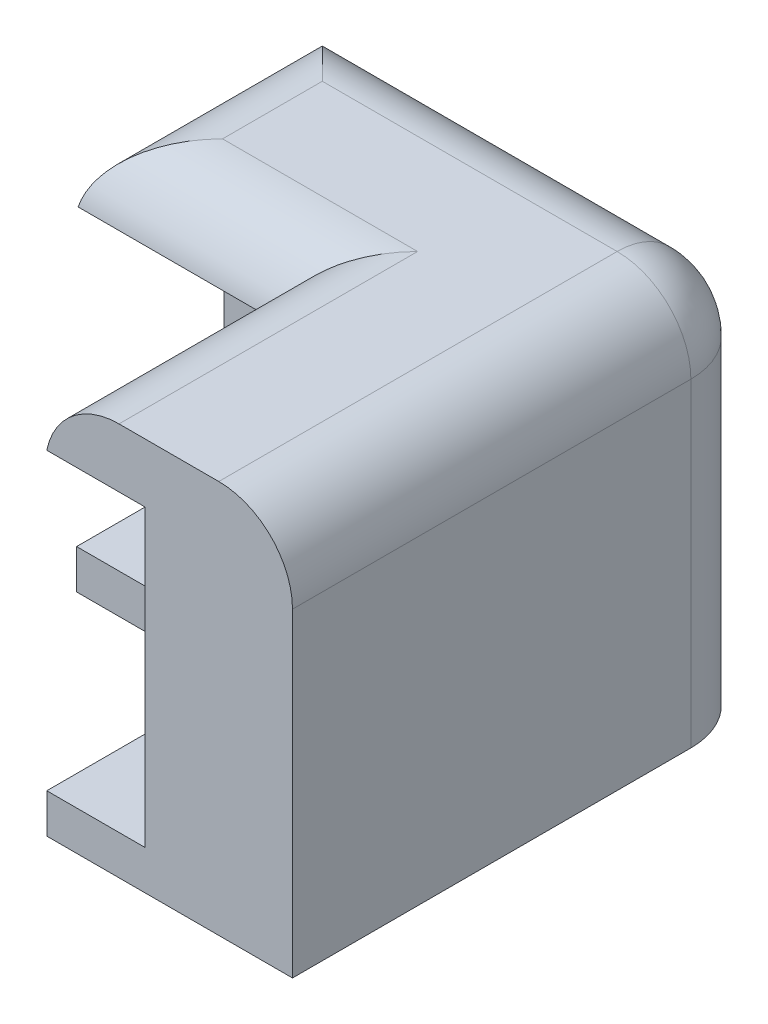
ISO-10303-21;
HEADER;
FILE_DESCRIPTION(('STEP AP214'),'2;1');
FILE_NAME('part.step','',(''),(''),'','','');
FILE_SCHEMA(('AUTOMOTIVE_DESIGN { 1 0 10303 214 1 1 1 1 }'));
ENDSEC;
DATA;
#1=APPLICATION_CONTEXT('core data for automotive mechanical design processes');
#2=APPLICATION_PROTOCOL_DEFINITION('international standard','automotive_design',2000,#1);
#3=PRODUCT_CONTEXT('',#1,'mechanical');
#4=PRODUCT('Part','Part','',(#3));
#5=PRODUCT_RELATED_PRODUCT_CATEGORY('part','',(#4));
#6=PRODUCT_DEFINITION_FORMATION('','',#4);
#7=PRODUCT_DEFINITION_CONTEXT('part definition',#1,'design');
#8=PRODUCT_DEFINITION('design','',#6,#7);
#9=PRODUCT_DEFINITION_SHAPE('','',#8);
#10=(LENGTH_UNIT() NAMED_UNIT(*) SI_UNIT(.MILLI.,.METRE.));
#11=(NAMED_UNIT(*) PLANE_ANGLE_UNIT() SI_UNIT($,.RADIAN.));
#12=(NAMED_UNIT(*) SI_UNIT($,.STERADIAN.) SOLID_ANGLE_UNIT());
#13=UNCERTAINTY_MEASURE_WITH_UNIT(LENGTH_MEASURE(1.E-05),#10,'distance_accuracy_value','');
#14=(GEOMETRIC_REPRESENTATION_CONTEXT(3) GLOBAL_UNCERTAINTY_ASSIGNED_CONTEXT((#13)) GLOBAL_UNIT_ASSIGNED_CONTEXT((#10,
#11,#12)) REPRESENTATION_CONTEXT('',''));
#15=CARTESIAN_POINT('',(0.,0.,0.));
#16=DIRECTION('',(0.,0.,1.));
#17=DIRECTION('',(1.,0.,0.));
#18=AXIS2_PLACEMENT_3D('',#15,#16,#17);
#19=CARTESIAN_POINT('',(0.,16.,0.));
#20=DIRECTION('',(0.,-1.,0.));
#21=DIRECTION('',(0.,0.,-1.));
#22=AXIS2_PLACEMENT_3D('',#19,#20,#21);
#23=PLANE('',#22);
#24=DIRECTION('',(0.,0.,-1.));
#25=VECTOR('',#24,1.);
#26=CARTESIAN_POINT('',(101.93938769134,16.,0.));
#27=LINE('',#26,#25);
#28=CARTESIAN_POINT('',(101.93938769134,16.,-59.9393876913398));
#29=VERTEX_POINT('',#28);
#30=CARTESIAN_POINT('',(101.93938769134,16.,-47.7864217896502));
#31=VERTEX_POINT('',#30);
#32=EDGE_CURVE('E189',#29,#31,#27,.F.);
#33=ORIENTED_EDGE('',*,*,#32,.T.);
#34=DIRECTION('',(1.,0.,0.));
#35=VECTOR('',#34,1.);
#36=CARTESIAN_POINT('',(0.,16.,-47.7864217896502));
#37=LINE('',#36,#35);
#38=CARTESIAN_POINT('',(106.,16.,-47.7864217896502));
#39=VERTEX_POINT('',#38);
#40=EDGE_CURVE('E151',#31,#39,#37,.T.);
#41=ORIENTED_EDGE('',*,*,#40,.T.);
#42=DIRECTION('',(0.,0.,-1.));
#43=VECTOR('',#42,1.);
#44=CARTESIAN_POINT('',(106.,16.,0.));
#45=LINE('',#44,#43);
#46=CARTESIAN_POINT('',(106.,16.,-64.));
#47=VERTEX_POINT('',#46);
#48=EDGE_CURVE('E181',#39,#47,#45,.T.);
#49=ORIENTED_EDGE('',*,*,#48,.T.);
#50=DIRECTION('',(-1.,0.,0.));
#51=VECTOR('',#50,1.);
#52=CARTESIAN_POINT('',(0.,16.,-64.));
#53=LINE('',#52,#51);
#54=CARTESIAN_POINT('',(94.,16.,-64.));
#55=VERTEX_POINT('',#54);
#56=EDGE_CURVE('E183',#47,#55,#53,.T.);
#57=ORIENTED_EDGE('',*,*,#56,.T.);
#58=DIRECTION('',(0.,0.,1.));
#59=VECTOR('',#58,1.);
#60=CARTESIAN_POINT('',(94.,16.,0.));
#61=LINE('',#60,#59);
#62=CARTESIAN_POINT('',(94.,16.,-59.9393876913398));
#63=VERTEX_POINT('',#62);
#64=EDGE_CURVE('E185',#55,#63,#61,.T.);
#65=ORIENTED_EDGE('',*,*,#64,.T.);
#66=DIRECTION('',(-1.,0.,0.));
#67=VECTOR('',#66,1.);
#68=CARTESIAN_POINT('',(0.,16.,-59.9393876913398));
#69=LINE('',#68,#67);
#70=EDGE_CURVE('E187',#63,#29,#69,.F.);
#71=ORIENTED_EDGE('',*,*,#70,.T.);
#72=EDGE_LOOP('',(#33,#41,#49,#57,#65,#71));
#73=FACE_BOUND('',#72,.T.);
#74=ADVANCED_FACE('F40',(#73),#23,.F.);
#75=CARTESIAN_POINT('',(0.,0.,0.));
#76=DIRECTION('',(0.,-1.,0.));
#77=DIRECTION('',(0.,0.,-1.));
#78=AXIS2_PLACEMENT_3D('',#75,#76,#77);
#79=PLANE('',#78);
#80=DIRECTION('',(1.,0.,0.));
#81=VECTOR('',#80,1.);
#82=CARTESIAN_POINT('',(-191.,0.,-47.7864217896502));
#83=LINE('',#82,#81);
#84=CARTESIAN_POINT('',(99.0000000000001,0.,-47.7864217896502));
#85=VERTEX_POINT('',#84);
#86=CARTESIAN_POINT('',(109.,0.,-47.7864217896502));
#87=VERTEX_POINT('',#86);
#88=EDGE_CURVE('E144',#85,#87,#83,.T.);
#89=ORIENTED_EDGE('',*,*,#88,.F.);
#90=DIRECTION('',(0.,0.,-1.));
#91=VECTOR('',#90,1.);
#92=CARTESIAN_POINT('',(99.0000000000001,0.,57.));
#93=LINE('',#92,#91);
#94=CARTESIAN_POINT('',(99.0000000000001,0.,-57.));
#95=VERTEX_POINT('',#94);
#96=EDGE_CURVE('E254',#85,#95,#93,.T.);
#97=ORIENTED_EDGE('',*,*,#96,.T.);
#98=DIRECTION('',(-1.,0.,0.));
#99=VECTOR('',#98,1.);
#100=CARTESIAN_POINT('',(-98.9999999999999,0.,-57.));
#101=LINE('',#100,#99);
#102=CARTESIAN_POINT('',(91.,0.,-57.));
#103=VERTEX_POINT('',#102);
#104=EDGE_CURVE('E172',#95,#103,#101,.T.);
#105=ORIENTED_EDGE('',*,*,#104,.T.);
#106=DIRECTION('',(0.,0.,-1.));
#107=VECTOR('',#106,1.);
#108=CARTESIAN_POINT('',(91.,0.,133.));
#109=LINE('',#108,#107);
#110=CARTESIAN_POINT('',(91.,0.,-67.));
#111=VERTEX_POINT('',#110);
#112=EDGE_CURVE('E258',#103,#111,#109,.T.);
#113=ORIENTED_EDGE('',*,*,#112,.T.);
#114=DIRECTION('',(-1.,0.,0.));
#115=VECTOR('',#114,1.);
#116=CARTESIAN_POINT('',(-109.,0.,-67.));
#117=LINE('',#116,#115);
#118=CARTESIAN_POINT('',(106.,0.,-67.));
#119=VERTEX_POINT('',#118);
#120=EDGE_CURVE('E166',#119,#111,#117,.T.);
#121=ORIENTED_EDGE('',*,*,#120,.F.);
#122=CARTESIAN_POINT('',(106.,0.,-64.));
#123=DIRECTION('',(0.,-1.,0.));
#124=DIRECTION('',(0.,0.,-1.));
#125=AXIS2_PLACEMENT_3D('',#122,#123,#124);
#126=CIRCLE('',#125,3.);
#127=CARTESIAN_POINT('',(109.,0.,-64.));
#128=VERTEX_POINT('',#127);
#129=EDGE_CURVE('E164',#119,#128,#126,.T.);
#130=ORIENTED_EDGE('',*,*,#129,.T.);
#131=DIRECTION('',(0.,0.,-1.));
#132=VECTOR('',#131,1.);
#133=CARTESIAN_POINT('',(109.,0.,67.));
#134=LINE('',#133,#132);
#135=EDGE_CURVE('E157',#87,#128,#134,.T.);
#136=ORIENTED_EDGE('',*,*,#135,.F.);
#137=EDGE_LOOP('',(#89,#97,#105,#113,#121,#130,#136));
#138=FACE_BOUND('',#137,.T.);
#139=ADVANCED_FACE('F161',(#138),#79,.T.);
#140=CARTESIAN_POINT('',(109.,16.,67.));
#141=DIRECTION('',(-1.,0.,0.));
#142=DIRECTION('',(0.,0.,1.));
#143=AXIS2_PLACEMENT_3D('',#140,#141,#142);
#144=PLANE('',#143);
#145=DIRECTION('',(0.,0.,-1.));
#146=VECTOR('',#145,1.);
#147=CARTESIAN_POINT('',(109.,13.,67.));
#148=LINE('',#147,#146);
#149=CARTESIAN_POINT('',(109.,13.,-64.));
#150=VERTEX_POINT('',#149);
#151=CARTESIAN_POINT('',(109.,13.,-47.7864217896502));
#152=VERTEX_POINT('',#151);
#153=EDGE_CURVE('E48',#150,#152,#148,.F.);
#154=ORIENTED_EDGE('',*,*,#153,.T.);
#155=DIRECTION('',(0.,1.,0.));
#156=VECTOR('',#155,1.);
#157=CARTESIAN_POINT('',(109.,0.,-47.7864217896502));
#158=LINE('',#157,#156);
#159=EDGE_CURVE('E54',#87,#152,#158,.T.);
#160=ORIENTED_EDGE('',*,*,#159,.F.);
#161=ORIENTED_EDGE('',*,*,#135,.T.);
#162=DIRECTION('',(0.,-1.,0.));
#163=VECTOR('',#162,1.);
#164=CARTESIAN_POINT('',(109.,16.,-64.));
#165=LINE('',#164,#163);
#166=EDGE_CURVE('E179',#128,#150,#165,.F.);
#167=ORIENTED_EDGE('',*,*,#166,.T.);
#168=EDGE_LOOP('',(#154,#160,#161,#167));
#169=FACE_BOUND('',#168,.T.);
#170=ADVANCED_FACE('F155',(#169),#144,.F.);
#171=CARTESIAN_POINT('',(-109.,16.,-67.));
#172=DIRECTION('',(0.,0.,1.));
#173=DIRECTION('',(1.,0.,0.));
#174=AXIS2_PLACEMENT_3D('',#171,#172,#173);
#175=PLANE('',#174);
#176=ORIENTED_EDGE('',*,*,#120,.T.);
#177=DIRECTION('',(0.,1.,0.));
#178=VECTOR('',#177,1.);
#179=CARTESIAN_POINT('',(91.,16.,-67.));
#180=LINE('',#179,#178);
#181=CARTESIAN_POINT('',(91.,13.,-67.));
#182=VERTEX_POINT('',#181);
#183=EDGE_CURVE('E216',#111,#182,#180,.T.);
#184=ORIENTED_EDGE('',*,*,#183,.T.);
#185=DIRECTION('',(-1.,0.,0.));
#186=VECTOR('',#185,1.);
#187=CARTESIAN_POINT('',(-109.,13.,-67.));
#188=LINE('',#187,#186);
#189=CARTESIAN_POINT('',(106.,13.,-67.));
#190=VERTEX_POINT('',#189);
#191=EDGE_CURVE('E198',#182,#190,#188,.F.);
#192=ORIENTED_EDGE('',*,*,#191,.T.);
#193=DIRECTION('',(0.,-1.,0.));
#194=VECTOR('',#193,1.);
#195=CARTESIAN_POINT('',(106.,16.,-67.));
#196=LINE('',#195,#194);
#197=EDGE_CURVE('E177',#190,#119,#196,.T.);
#198=ORIENTED_EDGE('',*,*,#197,.T.);
#199=EDGE_LOOP('',(#176,#184,#192,#198));
#200=FACE_BOUND('',#199,.T.);
#201=ADVANCED_FACE('F318',(#200),#175,.F.);
#202=CARTESIAN_POINT('',(99.0000000000001,16.,57.));
#203=DIRECTION('',(-1.,0.,0.));
#204=DIRECTION('',(0.,0.,1.));
#205=AXIS2_PLACEMENT_3D('',#202,#203,#204);
#206=PLANE('',#205);
#207=DIRECTION('',(0.,-1.,0.));
#208=VECTOR('',#207,1.);
#209=CARTESIAN_POINT('',(99.0000000000001,16.,-47.7864217896502));
#210=LINE('',#209,#208);
#211=CARTESIAN_POINT('',(99.0000000000001,1.59999999999999,-47.7864217896502));
#212=VERTEX_POINT('',#211);
#213=EDGE_CURVE('E147',#212,#85,#210,.T.);
#214=ORIENTED_EDGE('',*,*,#213,.F.);
#215=DIRECTION('',(0.,0.,1.));
#216=VECTOR('',#215,1.);
#217=CARTESIAN_POINT('',(99.0000000000001,1.59999999999999,57.));
#218=LINE('',#217,#216);
#219=CARTESIAN_POINT('',(99.0000000000001,1.59999999999999,-57.));
#220=VERTEX_POINT('',#219);
#221=EDGE_CURVE('E247',#220,#212,#218,.T.);
#222=ORIENTED_EDGE('',*,*,#221,.F.);
#223=DIRECTION('',(0.,-1.,0.));
#224=VECTOR('',#223,1.);
#225=CARTESIAN_POINT('',(99.0000000000001,16.,-57.));
#226=LINE('',#225,#224);
#227=EDGE_CURVE('E167',#220,#95,#226,.T.);
#228=ORIENTED_EDGE('',*,*,#227,.T.);
#229=ORIENTED_EDGE('',*,*,#96,.F.);
#230=EDGE_LOOP('',(#214,#222,#228,#229));
#231=FACE_BOUND('',#230,.T.);
#232=ADVANCED_FACE('F316',(#231),#206,.T.);
#233=CARTESIAN_POINT('',(-98.9999999999999,16.,-57.));
#234=DIRECTION('',(0.,0.,1.));
#235=DIRECTION('',(1.,0.,0.));
#236=AXIS2_PLACEMENT_3D('',#233,#234,#235);
#237=PLANE('',#236);
#238=DIRECTION('',(0.,1.,0.));
#239=VECTOR('',#238,1.);
#240=CARTESIAN_POINT('',(91.,16.,-57.));
#241=LINE('',#240,#239);
#242=CARTESIAN_POINT('',(91.,1.59999999999999,-57.));
#243=VERTEX_POINT('',#242);
#244=EDGE_CURVE('E62',#103,#243,#241,.T.);
#245=ORIENTED_EDGE('',*,*,#244,.F.);
#246=ORIENTED_EDGE('',*,*,#104,.F.);
#247=ORIENTED_EDGE('',*,*,#227,.F.);
#248=DIRECTION('',(1.,0.,0.));
#249=VECTOR('',#248,1.);
#250=CARTESIAN_POINT('',(-98.9999999999999,1.59999999999999,-57.));
#251=LINE('',#250,#249);
#252=EDGE_CURVE('E243',#243,#220,#251,.T.);
#253=ORIENTED_EDGE('',*,*,#252,.F.);
#254=EDGE_LOOP('',(#245,#246,#247,#253));
#255=FACE_BOUND('',#254,.T.);
#256=ADVANCED_FACE('F261',(#255),#237,.T.);
#257=CARTESIAN_POINT('',(103.,1.59999999999999,-63.));
#258=DIRECTION('',(0.,0.,-1.));
#259=DIRECTION('',(-1.,0.,0.));
#260=AXIS2_PLACEMENT_3D('',#257,#258,#259);
#261=PLANE('',#260);
#262=DIRECTION('',(-1.,0.,0.));
#263=VECTOR('',#262,1.);
#264=CARTESIAN_POINT('',(103.,13.6,-63.));
#265=LINE('',#264,#263);
#266=CARTESIAN_POINT('',(103.,13.6,-63.));
#267=VERTEX_POINT('',#266);
#268=CARTESIAN_POINT('',(91.0606123086602,13.6,-63.));
#269=VERTEX_POINT('',#268);
#270=EDGE_CURVE('E240',#267,#269,#265,.T.);
#271=ORIENTED_EDGE('',*,*,#270,.T.);
#272=CARTESIAN_POINT('',(94.,13.,-63.));
#273=DIRECTION('',(0.,0.,-1.));
#274=DIRECTION('',(-1.,0.,0.));
#275=AXIS2_PLACEMENT_3D('',#272,#273,#274);
#276=CIRCLE('',#275,3.);
#277=CARTESIAN_POINT('',(91.,13.,-63.));
#278=VERTEX_POINT('',#277);
#279=EDGE_CURVE('E194',#269,#278,#276,.F.);
#280=ORIENTED_EDGE('',*,*,#279,.T.);
#281=DIRECTION('',(0.,-1.,0.));
#282=VECTOR('',#281,1.);
#283=CARTESIAN_POINT('',(91.,1.59999999999999,-63.));
#284=LINE('',#283,#282);
#285=CARTESIAN_POINT('',(91.,1.59999999999999,-63.));
#286=VERTEX_POINT('',#285);
#287=EDGE_CURVE('E222',#278,#286,#284,.T.);
#288=ORIENTED_EDGE('',*,*,#287,.T.);
#289=DIRECTION('',(-1.,0.,0.));
#290=VECTOR('',#289,1.);
#291=CARTESIAN_POINT('',(103.,1.59999999999999,-63.));
#292=LINE('',#291,#290);
#293=CARTESIAN_POINT('',(103.,1.59999999999999,-63.));
#294=VERTEX_POINT('',#293);
#295=EDGE_CURVE('E239',#294,#286,#292,.T.);
#296=ORIENTED_EDGE('',*,*,#295,.F.);
#297=DIRECTION('',(0.,-1.,0.));
#298=VECTOR('',#297,1.);
#299=CARTESIAN_POINT('',(103.,1.59999999999999,-63.));
#300=LINE('',#299,#298);
#301=EDGE_CURVE('E227',#267,#294,#300,.T.);
#302=ORIENTED_EDGE('',*,*,#301,.F.);
#303=EDGE_LOOP('',(#271,#280,#288,#296,#302));
#304=FACE_BOUND('',#303,.T.);
#305=ADVANCED_FACE('F325',(#304),#261,.F.);
#306=CARTESIAN_POINT('',(103.,13.6,-63.));
#307=DIRECTION('',(0.,1.,0.));
#308=DIRECTION('',(0.,0.,1.));
#309=AXIS2_PLACEMENT_3D('',#306,#307,#308);
#310=PLANE('',#309);
#311=DIRECTION('',(0.,0.,-1.));
#312=VECTOR('',#311,1.);
#313=CARTESIAN_POINT('',(103.,13.6,-63.));
#314=LINE('',#313,#312);
#315=CARTESIAN_POINT('',(103.,13.6,-47.7864217896502));
#316=VERTEX_POINT('',#315);
#317=EDGE_CURVE('E237',#316,#267,#314,.T.);
#318=ORIENTED_EDGE('',*,*,#317,.F.);
#319=DIRECTION('',(-1.,0.,0.));
#320=VECTOR('',#319,1.);
#321=CARTESIAN_POINT('',(103.,13.6,-47.7864217896502));
#322=LINE('',#321,#320);
#323=CARTESIAN_POINT('',(99.0000000000001,13.6,-47.7864217896502));
#324=VERTEX_POINT('',#323);
#325=EDGE_CURVE('E274',#316,#324,#322,.T.);
#326=ORIENTED_EDGE('',*,*,#325,.T.);
#327=DIRECTION('',(0.,0.,-1.));
#328=VECTOR('',#327,1.);
#329=CARTESIAN_POINT('',(99.0000000000001,13.6,57.));
#330=LINE('',#329,#328);
#331=CARTESIAN_POINT('',(99.0000000000001,13.6,-57.));
#332=VERTEX_POINT('',#331);
#333=EDGE_CURVE('E252',#324,#332,#330,.T.);
#334=ORIENTED_EDGE('',*,*,#333,.T.);
#335=DIRECTION('',(-1.,0.,0.));
#336=VECTOR('',#335,1.);
#337=CARTESIAN_POINT('',(-98.9999999999999,13.6,-57.));
#338=LINE('',#337,#336);
#339=CARTESIAN_POINT('',(91.0606123086602,13.6,-57.));
#340=VERTEX_POINT('',#339);
#341=EDGE_CURVE('E250',#332,#340,#338,.T.);
#342=ORIENTED_EDGE('',*,*,#341,.T.);
#343=DIRECTION('',(0.,0.,1.));
#344=VECTOR('',#343,1.);
#345=CARTESIAN_POINT('',(91.0606123086602,13.6,-57.));
#346=LINE('',#345,#344);
#347=EDGE_CURVE('E192',#340,#269,#346,.F.);
#348=ORIENTED_EDGE('',*,*,#347,.T.);
#349=ORIENTED_EDGE('',*,*,#270,.F.);
#350=EDGE_LOOP('',(#318,#326,#334,#342,#348,#349));
#351=FACE_BOUND('',#350,.T.);
#352=ADVANCED_FACE('F307',(#351),#310,.F.);
#353=CARTESIAN_POINT('',(103.,1.59999999999999,63.));
#354=DIRECTION('',(0.,-1.,0.));
#355=DIRECTION('',(0.,0.,-1.));
#356=AXIS2_PLACEMENT_3D('',#353,#354,#355);
#357=PLANE('',#356);
#358=ORIENTED_EDGE('',*,*,#221,.T.);
#359=DIRECTION('',(1.,0.,0.));
#360=VECTOR('',#359,1.);
#361=CARTESIAN_POINT('',(103.,1.59999999999999,-47.7864217896502));
#362=LINE('',#361,#360);
#363=CARTESIAN_POINT('',(103.,1.59999999999999,-47.7864217896502));
#364=VERTEX_POINT('',#363);
#365=EDGE_CURVE('E268',#212,#364,#362,.T.);
#366=ORIENTED_EDGE('',*,*,#365,.T.);
#367=DIRECTION('',(0.,0.,1.));
#368=VECTOR('',#367,1.);
#369=CARTESIAN_POINT('',(103.,1.59999999999999,63.));
#370=LINE('',#369,#368);
#371=EDGE_CURVE('E234',#294,#364,#370,.T.);
#372=ORIENTED_EDGE('',*,*,#371,.F.);
#373=ORIENTED_EDGE('',*,*,#295,.T.);
#374=DIRECTION('',(0.,0.,1.));
#375=VECTOR('',#374,1.);
#376=CARTESIAN_POINT('',(91.,1.59999999999999,63.));
#377=LINE('',#376,#375);
#378=EDGE_CURVE('E263',#286,#243,#377,.T.);
#379=ORIENTED_EDGE('',*,*,#378,.T.);
#380=ORIENTED_EDGE('',*,*,#252,.T.);
#381=EDGE_LOOP('',(#358,#366,#372,#373,#379,#380));
#382=FACE_BOUND('',#381,.T.);
#383=ADVANCED_FACE('F313',(#382),#357,.F.);
#384=CARTESIAN_POINT('',(103.,0.,0.));
#385=DIRECTION('',(1.,0.,0.));
#386=DIRECTION('',(0.,0.,-1.));
#387=AXIS2_PLACEMENT_3D('',#384,#385,#386);
#388=PLANE('',#387);
#389=ORIENTED_EDGE('',*,*,#371,.T.);
#390=DIRECTION('',(0.,1.,0.));
#391=VECTOR('',#390,1.);
#392=CARTESIAN_POINT('',(103.,0.,-47.7864217896502));
#393=LINE('',#392,#391);
#394=EDGE_CURVE('E271',#364,#316,#393,.T.);
#395=ORIENTED_EDGE('',*,*,#394,.T.);
#396=ORIENTED_EDGE('',*,*,#317,.T.);
#397=ORIENTED_EDGE('',*,*,#301,.T.);
#398=EDGE_LOOP('',(#389,#395,#396,#397));
#399=FACE_BOUND('',#398,.T.);
#400=ADVANCED_FACE('F311',(#399),#388,.F.);
#401=CARTESIAN_POINT('',(91.,16.,-67.));
#402=DIRECTION('',(1.,0.,0.));
#403=DIRECTION('',(0.,0.,-1.));
#404=AXIS2_PLACEMENT_3D('',#401,#402,#403);
#405=PLANE('',#404);
#406=ORIENTED_EDGE('',*,*,#287,.F.);
#407=DIRECTION('',(0.,0.,1.));
#408=VECTOR('',#407,1.);
#409=CARTESIAN_POINT('',(91.,13.,-67.));
#410=LINE('',#409,#408);
#411=EDGE_CURVE('E196',#278,#182,#410,.F.);
#412=ORIENTED_EDGE('',*,*,#411,.T.);
#413=ORIENTED_EDGE('',*,*,#183,.F.);
#414=ORIENTED_EDGE('',*,*,#112,.F.);
#415=ORIENTED_EDGE('',*,*,#244,.T.);
#416=ORIENTED_EDGE('',*,*,#378,.F.);
#417=EDGE_LOOP('',(#406,#412,#413,#414,#415,#416));
#418=FACE_BOUND('',#417,.T.);
#419=ADVANCED_FACE('F341',(#418),#405,.F.);
#420=CARTESIAN_POINT('',(106.,16.,-64.));
#421=DIRECTION('',(0.,-1.,0.));
#422=DIRECTION('',(0.,0.,-1.));
#423=AXIS2_PLACEMENT_3D('',#420,#421,#422);
#424=CYLINDRICAL_SURFACE('',#423,3.);
#425=ORIENTED_EDGE('',*,*,#197,.F.);
#426=CARTESIAN_POINT('',(106.,13.,-64.));
#427=DIRECTION('',(0.,-1.,0.));
#428=DIRECTION('',(0.,0.,-1.));
#429=AXIS2_PLACEMENT_3D('',#426,#427,#428);
#430=CIRCLE('',#429,3.);
#431=EDGE_CURVE('E200',#190,#150,#430,.T.);
#432=ORIENTED_EDGE('',*,*,#431,.T.);
#433=ORIENTED_EDGE('',*,*,#166,.F.);
#434=ORIENTED_EDGE('',*,*,#129,.F.);
#435=EDGE_LOOP('',(#425,#432,#433,#434));
#436=FACE_BOUND('',#435,.T.);
#437=ADVANCED_FACE('F338',(#436),#424,.T.);
#438=CARTESIAN_POINT('',(-98.9999999999999,13.,-59.9393876913398));
#439=DIRECTION('',(-1.,0.,0.));
#440=DIRECTION('',(0.,0.,1.));
#441=AXIS2_PLACEMENT_3D('',#438,#439,#440);
#442=CYLINDRICAL_SURFACE('',#441,3.);
#443=CARTESIAN_POINT('',(94.,13.,-59.9393876913398));
#444=DIRECTION('',(0.707106781186548,0.,0.707106781186547));
#445=DIRECTION('',(-0.707106781186547,0.,0.707106781186547));
#446=AXIS2_PLACEMENT_3D('',#443,#444,#445);
#447=ELLIPSE('',#446,4.24264068711929,3.);
#448=EDGE_CURVE('E212',#340,#63,#447,.F.);
#449=ORIENTED_EDGE('',*,*,#448,.F.);
#450=ORIENTED_EDGE('',*,*,#341,.F.);
#451=CARTESIAN_POINT('',(101.93938769134,13.,-59.9393876913398));
#452=DIRECTION('',(-0.707106781186548,0.,-0.707106781186547));
#453=DIRECTION('',(0.707106781186547,0.,-0.707106781186547));
#454=AXIS2_PLACEMENT_3D('',#451,#452,#453);
#455=ELLIPSE('',#454,4.24264068711929,3.);
#456=EDGE_CURVE('E214',#29,#332,#455,.F.);
#457=ORIENTED_EDGE('',*,*,#456,.F.);
#458=ORIENTED_EDGE('',*,*,#70,.F.);
#459=EDGE_LOOP('',(#449,#450,#457,#458));
#460=FACE_BOUND('',#459,.T.);
#461=ADVANCED_FACE('F42',(#460),#442,.T.);
#462=CARTESIAN_POINT('',(101.93938769134,13.,57.));
#463=DIRECTION('',(0.,0.,-1.));
#464=DIRECTION('',(-1.,0.,0.));
#465=AXIS2_PLACEMENT_3D('',#462,#463,#464);
#466=CYLINDRICAL_SURFACE('',#465,3.);
#467=CARTESIAN_POINT('',(101.93938769134,13.,-47.7864217896502));
#468=DIRECTION('',(0.,0.,-1.));
#469=DIRECTION('',(-1.,0.,0.));
#470=AXIS2_PLACEMENT_3D('',#467,#468,#469);
#471=CIRCLE('',#470,3.);
#472=EDGE_CURVE('E277',#31,#324,#471,.F.);
#473=ORIENTED_EDGE('',*,*,#472,.F.);
#474=ORIENTED_EDGE('',*,*,#32,.F.);
#475=ORIENTED_EDGE('',*,*,#456,.T.);
#476=ORIENTED_EDGE('',*,*,#333,.F.);
#477=EDGE_LOOP('',(#473,#474,#475,#476));
#478=FACE_BOUND('',#477,.T.);
#479=ADVANCED_FACE('F304',(#478),#466,.T.);
#480=CARTESIAN_POINT('',(94.,13.,0.));
#481=DIRECTION('',(0.,0.,1.));
#482=DIRECTION('',(1.,0.,0.));
#483=AXIS2_PLACEMENT_3D('',#480,#481,#482);
#484=CYLINDRICAL_SURFACE('',#483,3.);
#485=ORIENTED_EDGE('',*,*,#448,.T.);
#486=ORIENTED_EDGE('',*,*,#64,.F.);
#487=CARTESIAN_POINT('',(94.,13.,-64.));
#488=DIRECTION('',(-0.707106781186547,0.,0.707106781186547));
#489=DIRECTION('',(-0.707106781186547,0.,-0.707106781186547));
#490=AXIS2_PLACEMENT_3D('',#487,#488,#489);
#491=ELLIPSE('',#490,4.24264068711928,3.);
#492=EDGE_CURVE('E209',#182,#55,#491,.F.);
#493=ORIENTED_EDGE('',*,*,#492,.F.);
#494=ORIENTED_EDGE('',*,*,#411,.F.);
#495=ORIENTED_EDGE('',*,*,#279,.F.);
#496=ORIENTED_EDGE('',*,*,#347,.F.);
#497=EDGE_LOOP('',(#485,#486,#493,#494,#495,#496));
#498=FACE_BOUND('',#497,.T.);
#499=ADVANCED_FACE('F297',(#498),#484,.T.);
#500=CARTESIAN_POINT('',(0.,13.,-64.));
#501=DIRECTION('',(-1.,0.,0.));
#502=DIRECTION('',(0.,0.,1.));
#503=AXIS2_PLACEMENT_3D('',#500,#501,#502);
#504=CYLINDRICAL_SURFACE('',#503,3.);
#505=ORIENTED_EDGE('',*,*,#492,.T.);
#506=ORIENTED_EDGE('',*,*,#56,.F.);
#507=CARTESIAN_POINT('',(106.,13.,-64.));
#508=DIRECTION('',(1.,0.,0.));
#509=DIRECTION('',(0.,0.,-1.));
#510=AXIS2_PLACEMENT_3D('',#507,#508,#509);
#511=CIRCLE('',#510,3.);
#512=EDGE_CURVE('E206',#190,#47,#511,.T.);
#513=ORIENTED_EDGE('',*,*,#512,.F.);
#514=ORIENTED_EDGE('',*,*,#191,.F.);
#515=EDGE_LOOP('',(#505,#506,#513,#514));
#516=FACE_BOUND('',#515,.T.);
#517=ADVANCED_FACE('F293',(#516),#504,.T.);
#518=CARTESIAN_POINT('',(106.,13.,-64.));
#519=DIRECTION('',(0.,-1.,0.));
#520=DIRECTION('',(0.,0.,-1.));
#521=AXIS2_PLACEMENT_3D('',#518,#519,#520);
#522=SPHERICAL_SURFACE('',#521,3.);
#523=ORIENTED_EDGE('',*,*,#431,.F.);
#524=ORIENTED_EDGE('',*,*,#512,.T.);
#525=CARTESIAN_POINT('',(106.,13.,-64.));
#526=DIRECTION('',(0.,0.,1.));
#527=DIRECTION('',(1.,0.,0.));
#528=AXIS2_PLACEMENT_3D('',#525,#526,#527);
#529=CIRCLE('',#528,3.);
#530=EDGE_CURVE('E203',#150,#47,#529,.T.);
#531=ORIENTED_EDGE('',*,*,#530,.F.);
#532=EDGE_LOOP('',(#523,#524,#531));
#533=FACE_BOUND('',#532,.T.);
#534=ADVANCED_FACE('F289',(#533),#522,.T.);
#535=CARTESIAN_POINT('',(106.,13.,0.));
#536=DIRECTION('',(0.,0.,-1.));
#537=DIRECTION('',(-1.,0.,0.));
#538=AXIS2_PLACEMENT_3D('',#535,#536,#537);
#539=CYLINDRICAL_SURFACE('',#538,3.);
#540=CARTESIAN_POINT('',(106.,13.,-47.7864217896502));
#541=DIRECTION('',(0.,0.,-1.));
#542=DIRECTION('',(-1.,0.,0.));
#543=AXIS2_PLACEMENT_3D('',#540,#541,#542);
#544=CIRCLE('',#543,3.);
#545=EDGE_CURVE('E11',#152,#39,#544,.F.);
#546=ORIENTED_EDGE('',*,*,#545,.F.);
#547=ORIENTED_EDGE('',*,*,#153,.F.);
#548=ORIENTED_EDGE('',*,*,#530,.T.);
#549=ORIENTED_EDGE('',*,*,#48,.F.);
#550=EDGE_LOOP('',(#546,#547,#548,#549));
#551=FACE_BOUND('',#550,.T.);
#552=ADVANCED_FACE('F285',(#551),#539,.T.);
#553=CARTESIAN_POINT('',(-191.,0.,-47.7864217896502));
#554=DIRECTION('',(0.,0.,-1.));
#555=DIRECTION('',(-1.,0.,0.));
#556=AXIS2_PLACEMENT_3D('',#553,#554,#555);
#557=PLANE('',#556);
#558=ORIENTED_EDGE('',*,*,#213,.T.);
#559=ORIENTED_EDGE('',*,*,#88,.T.);
#560=ORIENTED_EDGE('',*,*,#159,.T.);
#561=ORIENTED_EDGE('',*,*,#545,.T.);
#562=ORIENTED_EDGE('',*,*,#40,.F.);
#563=ORIENTED_EDGE('',*,*,#472,.T.);
#564=ORIENTED_EDGE('',*,*,#325,.F.);
#565=ORIENTED_EDGE('',*,*,#394,.F.);
#566=ORIENTED_EDGE('',*,*,#365,.F.);
#567=EDGE_LOOP('',(#558,#559,#560,#561,#562,#563,#564,#565,#566));
#568=FACE_BOUND('',#567,.T.);
#569=ADVANCED_FACE('F145',(#568),#557,.F.);
#570=CLOSED_SHELL('',(#74,#139,#170,#201,#232,#256,#305,#352,#383,#400,#419,#437,#461,#479,#499,
#517,#534,#552,#569));
#571=MANIFOLD_SOLID_BREP('B2',#570);
#572=ADVANCED_BREP_SHAPE_REPRESENTATION('',(#18,#571),#14);
#573=SHAPE_DEFINITION_REPRESENTATION(#9,#572);
ENDSEC;
END-ISO-10303-21;
